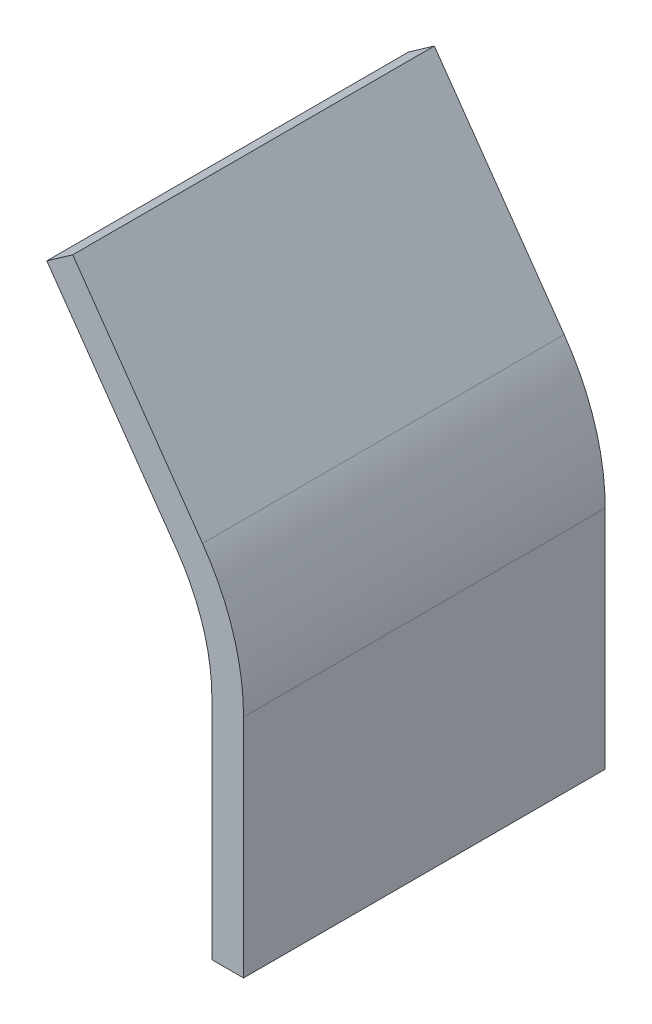
ISO-10303-21;
HEADER;
FILE_DESCRIPTION(('STEP AP214'),'2;1');
FILE_NAME('part.step','',(''),(''),'','','');
FILE_SCHEMA(('AUTOMOTIVE_DESIGN { 1 0 10303 214 1 1 1 1 }'));
ENDSEC;
DATA;
#1=APPLICATION_CONTEXT('core data for automotive mechanical design processes');
#2=APPLICATION_PROTOCOL_DEFINITION('international standard','automotive_design',2000,#1);
#3=PRODUCT_CONTEXT('',#1,'mechanical');
#4=PRODUCT('Part','Part','',(#3));
#5=PRODUCT_RELATED_PRODUCT_CATEGORY('part','',(#4));
#6=PRODUCT_DEFINITION_FORMATION('','',#4);
#7=PRODUCT_DEFINITION_CONTEXT('part definition',#1,'design');
#8=PRODUCT_DEFINITION('design','',#6,#7);
#9=PRODUCT_DEFINITION_SHAPE('','',#8);
#10=(LENGTH_UNIT() NAMED_UNIT(*) SI_UNIT(.MILLI.,.METRE.));
#11=(NAMED_UNIT(*) PLANE_ANGLE_UNIT() SI_UNIT($,.RADIAN.));
#12=(NAMED_UNIT(*) SI_UNIT($,.STERADIAN.) SOLID_ANGLE_UNIT());
#13=UNCERTAINTY_MEASURE_WITH_UNIT(LENGTH_MEASURE(1.E-05),#10,'distance_accuracy_value','');
#14=(GEOMETRIC_REPRESENTATION_CONTEXT(3) GLOBAL_UNCERTAINTY_ASSIGNED_CONTEXT((#13)) GLOBAL_UNIT_ASSIGNED_CONTEXT((#10,
#11,#12)) REPRESENTATION_CONTEXT('',''));
#15=CARTESIAN_POINT('',(0.,0.,0.));
#16=DIRECTION('',(0.,0.,1.));
#17=DIRECTION('',(1.,0.,0.));
#18=AXIS2_PLACEMENT_3D('',#15,#16,#17);
#19=CARTESIAN_POINT('',(-3.5,25.,20.));
#20=DIRECTION('',(1.,0.,0.));
#21=DIRECTION('',(0.,0.,-1.));
#22=AXIS2_PLACEMENT_3D('',#19,#20,#21);
#23=PLANE('',#22);
#24=DIRECTION('',(0.,1.,0.));
#25=VECTOR('',#24,1.);
#26=CARTESIAN_POINT('',(-3.5,25.,-20.));
#27=LINE('',#26,#25);
#28=CARTESIAN_POINT('',(-3.5,25.,-20.));
#29=VERTEX_POINT('',#28);
#30=CARTESIAN_POINT('',(-3.5,0.,-20.));
#31=VERTEX_POINT('',#30);
#32=EDGE_CURVE('E142',#29,#31,#27,.F.);
#33=ORIENTED_EDGE('',*,*,#32,.T.);
#34=DIRECTION('',(0.,0.,-1.));
#35=VECTOR('',#34,1.);
#36=CARTESIAN_POINT('',(-3.5,0.,20.));
#37=LINE('',#36,#35);
#38=CARTESIAN_POINT('',(-3.5,0.,20.));
#39=VERTEX_POINT('',#38);
#40=EDGE_CURVE('E11',#39,#31,#37,.T.);
#41=ORIENTED_EDGE('',*,*,#40,.F.);
#42=DIRECTION('',(0.,1.,0.));
#43=VECTOR('',#42,1.);
#44=CARTESIAN_POINT('',(-3.5,25.,20.));
#45=LINE('',#44,#43);
#46=CARTESIAN_POINT('',(-3.5,25.,20.));
#47=VERTEX_POINT('',#46);
#48=EDGE_CURVE('E95',#47,#39,#45,.F.);
#49=ORIENTED_EDGE('',*,*,#48,.F.);
#50=DIRECTION('',(0.,0.,-1.));
#51=VECTOR('',#50,1.);
#52=CARTESIAN_POINT('',(-3.5,25.,20.));
#53=LINE('',#52,#51);
#54=EDGE_CURVE('E141',#47,#29,#53,.T.);
#55=ORIENTED_EDGE('',*,*,#54,.T.);
#56=EDGE_LOOP('',(#33,#41,#49,#55));
#57=FACE_BOUND('',#56,.T.);
#58=ADVANCED_FACE('F39',(#57),#23,.F.);
#59=CARTESIAN_POINT('',(0.,0.,20.));
#60=DIRECTION('',(0.,-1.,0.));
#61=DIRECTION('',(0.,0.,-1.));
#62=AXIS2_PLACEMENT_3D('',#59,#60,#61);
#63=PLANE('',#62);
#64=DIRECTION('',(-1.,0.,0.));
#65=VECTOR('',#64,1.);
#66=CARTESIAN_POINT('',(0.,0.,-20.));
#67=LINE('',#66,#65);
#68=CARTESIAN_POINT('',(0.,0.,-20.));
#69=VERTEX_POINT('',#68);
#70=EDGE_CURVE('E146',#69,#31,#67,.T.);
#71=ORIENTED_EDGE('',*,*,#70,.F.);
#72=DIRECTION('',(0.,0.,-1.));
#73=VECTOR('',#72,1.);
#74=CARTESIAN_POINT('',(0.,0.,20.));
#75=LINE('',#74,#73);
#76=CARTESIAN_POINT('',(0.,0.,20.));
#77=VERTEX_POINT('',#76);
#78=EDGE_CURVE('E48',#77,#69,#75,.T.);
#79=ORIENTED_EDGE('',*,*,#78,.F.);
#80=DIRECTION('',(-1.,0.,0.));
#81=VECTOR('',#80,1.);
#82=CARTESIAN_POINT('',(0.,0.,20.));
#83=LINE('',#82,#81);
#84=EDGE_CURVE('E198',#77,#39,#83,.T.);
#85=ORIENTED_EDGE('',*,*,#84,.T.);
#86=ORIENTED_EDGE('',*,*,#40,.T.);
#87=EDGE_LOOP('',(#71,#79,#85,#86));
#88=FACE_BOUND('',#87,.T.);
#89=ADVANCED_FACE('F189',(#88),#63,.T.);
#90=CARTESIAN_POINT('',(0.,25.,20.));
#91=DIRECTION('',(1.,0.,0.));
#92=DIRECTION('',(0.,0.,-1.));
#93=AXIS2_PLACEMENT_3D('',#90,#91,#92);
#94=PLANE('',#93);
#95=DIRECTION('',(0.,-1.,0.));
#96=VECTOR('',#95,1.);
#97=CARTESIAN_POINT('',(0.,25.,-20.));
#98=LINE('',#97,#96);
#99=CARTESIAN_POINT('',(0.,25.,-20.));
#100=VERTEX_POINT('',#99);
#101=EDGE_CURVE('E150',#100,#69,#98,.T.);
#102=ORIENTED_EDGE('',*,*,#101,.F.);
#103=DIRECTION('',(0.,0.,-1.));
#104=VECTOR('',#103,1.);
#105=CARTESIAN_POINT('',(0.,25.,20.));
#106=LINE('',#105,#104);
#107=CARTESIAN_POINT('',(0.,25.,20.));
#108=VERTEX_POINT('',#107);
#109=EDGE_CURVE('E177',#108,#100,#106,.T.);
#110=ORIENTED_EDGE('',*,*,#109,.F.);
#111=DIRECTION('',(0.,-1.,0.));
#112=VECTOR('',#111,1.);
#113=CARTESIAN_POINT('',(0.,25.,20.));
#114=LINE('',#113,#112);
#115=EDGE_CURVE('E186',#108,#77,#114,.T.);
#116=ORIENTED_EDGE('',*,*,#115,.T.);
#117=ORIENTED_EDGE('',*,*,#78,.T.);
#118=EDGE_LOOP('',(#102,#110,#116,#117));
#119=FACE_BOUND('',#118,.T.);
#120=ADVANCED_FACE('F184',(#119),#94,.T.);
#121=CARTESIAN_POINT('',(-25.,25.,20.));
#122=DIRECTION('',(0.,0.,-1.));
#123=DIRECTION('',(-1.,0.,0.));
#124=AXIS2_PLACEMENT_3D('',#121,#122,#123);
#125=CYLINDRICAL_SURFACE('',#124,25.);
#126=CARTESIAN_POINT('',(-25.,25.,-20.));
#127=DIRECTION('',(0.,0.,-1.));
#128=DIRECTION('',(-1.,0.,0.));
#129=AXIS2_PLACEMENT_3D('',#126,#127,#128);
#130=CIRCLE('',#129,25.);
#131=CARTESIAN_POINT('',(-4.53622631477816,39.3608483927664,-20.));
#132=VERTEX_POINT('',#131);
#133=EDGE_CURVE('E154',#132,#100,#130,.T.);
#134=ORIENTED_EDGE('',*,*,#133,.F.);
#135=DIRECTION('',(0.,0.,-1.));
#136=VECTOR('',#135,1.);
#137=CARTESIAN_POINT('',(-4.53622631477816,39.3608483927664,20.));
#138=LINE('',#137,#136);
#139=CARTESIAN_POINT('',(-4.53622631477816,39.3608483927664,20.));
#140=VERTEX_POINT('',#139);
#141=EDGE_CURVE('E174',#140,#132,#138,.T.);
#142=ORIENTED_EDGE('',*,*,#141,.F.);
#143=CARTESIAN_POINT('',(-25.,25.,20.));
#144=DIRECTION('',(0.,0.,-1.));
#145=DIRECTION('',(-1.,0.,0.));
#146=AXIS2_PLACEMENT_3D('',#143,#144,#145);
#147=CIRCLE('',#146,25.);
#148=EDGE_CURVE('E135',#140,#108,#147,.T.);
#149=ORIENTED_EDGE('',*,*,#148,.T.);
#150=ORIENTED_EDGE('',*,*,#109,.T.);
#151=EDGE_LOOP('',(#134,#142,#149,#150));
#152=FACE_BOUND('',#151,.T.);
#153=ADVANCED_FACE('F196',(#152),#125,.T.);
#154=CARTESIAN_POINT('',(-18.8970747075446,59.8246220779883,20.));
#155=DIRECTION('',(0.818550947408874,0.574433935710657,0.));
#156=DIRECTION('',(-0.574433935710657,0.818550947408874,0.));
#157=AXIS2_PLACEMENT_3D('',#154,#155,#156);
#158=PLANE('',#157);
#159=DIRECTION('',(0.574433935710657,-0.818550947408874,0.));
#160=VECTOR('',#159,1.);
#161=CARTESIAN_POINT('',(-18.8970747075446,59.8246220779883,-20.));
#162=LINE('',#161,#160);
#163=CARTESIAN_POINT('',(-18.8970747075446,59.8246220779883,-20.));
#164=VERTEX_POINT('',#163);
#165=EDGE_CURVE('E158',#164,#132,#162,.T.);
#166=ORIENTED_EDGE('',*,*,#165,.F.);
#167=DIRECTION('',(0.,0.,-1.));
#168=VECTOR('',#167,1.);
#169=CARTESIAN_POINT('',(-18.8970747075446,59.8246220779883,20.));
#170=LINE('',#169,#168);
#171=CARTESIAN_POINT('',(-18.8970747075446,59.8246220779883,20.));
#172=VERTEX_POINT('',#171);
#173=EDGE_CURVE('E120',#172,#164,#170,.T.);
#174=ORIENTED_EDGE('',*,*,#173,.F.);
#175=DIRECTION('',(0.574433935710657,-0.818550947408874,0.));
#176=VECTOR('',#175,1.);
#177=CARTESIAN_POINT('',(-18.8970747075446,59.8246220779883,20.));
#178=LINE('',#177,#176);
#179=EDGE_CURVE('E131',#172,#140,#178,.T.);
#180=ORIENTED_EDGE('',*,*,#179,.T.);
#181=ORIENTED_EDGE('',*,*,#141,.T.);
#182=EDGE_LOOP('',(#166,#174,#180,#181));
#183=FACE_BOUND('',#182,.T.);
#184=ADVANCED_FACE('F207',(#183),#158,.T.);
#185=CARTESIAN_POINT('',(-21.7620030234756,57.814103303001,20.));
#186=DIRECTION('',(-0.574433935710657,0.818550947408874,0.));
#187=DIRECTION('',(-0.818550947408874,-0.574433935710657,0.));
#188=AXIS2_PLACEMENT_3D('',#185,#186,#187);
#189=PLANE('',#188);
#190=DIRECTION('',(0.818550947408874,0.574433935710657,0.));
#191=VECTOR('',#190,1.);
#192=CARTESIAN_POINT('',(-21.7620030234756,57.814103303001,-20.));
#193=LINE('',#192,#191);
#194=CARTESIAN_POINT('',(-21.7620030234756,57.814103303001,-20.));
#195=VERTEX_POINT('',#194);
#196=EDGE_CURVE('E118',#195,#164,#193,.T.);
#197=ORIENTED_EDGE('',*,*,#196,.F.);
#198=DIRECTION('',(0.,0.,-1.));
#199=VECTOR('',#198,1.);
#200=CARTESIAN_POINT('',(-21.7620030234756,57.814103303001,20.));
#201=LINE('',#200,#199);
#202=CARTESIAN_POINT('',(-21.7620030234756,57.814103303001,20.));
#203=VERTEX_POINT('',#202);
#204=EDGE_CURVE('E112',#203,#195,#201,.T.);
#205=ORIENTED_EDGE('',*,*,#204,.F.);
#206=DIRECTION('',(0.818550947408874,0.574433935710657,0.));
#207=VECTOR('',#206,1.);
#208=CARTESIAN_POINT('',(-21.7620030234756,57.814103303001,20.));
#209=LINE('',#208,#207);
#210=EDGE_CURVE('E116',#203,#172,#209,.T.);
#211=ORIENTED_EDGE('',*,*,#210,.T.);
#212=ORIENTED_EDGE('',*,*,#173,.T.);
#213=EDGE_LOOP('',(#197,#205,#211,#212));
#214=FACE_BOUND('',#213,.T.);
#215=ADVANCED_FACE('F114',(#214),#189,.T.);
#216=CARTESIAN_POINT('',(-21.7620030234756,57.814103303001,20.));
#217=DIRECTION('',(0.818550947408874,0.574433935710657,0.));
#218=DIRECTION('',(-0.574433935710657,0.818550947408874,0.));
#219=AXIS2_PLACEMENT_3D('',#216,#217,#218);
#220=PLANE('',#219);
#221=DIRECTION('',(0.574433935710657,-0.818550947408874,0.));
#222=VECTOR('',#221,1.);
#223=CARTESIAN_POINT('',(-21.7620030234756,57.814103303001,-20.));
#224=LINE('',#223,#222);
#225=CARTESIAN_POINT('',(-7.40115463070921,37.3503296177791,-20.));
#226=VERTEX_POINT('',#225);
#227=EDGE_CURVE('E83',#195,#226,#224,.T.);
#228=ORIENTED_EDGE('',*,*,#227,.T.);
#229=DIRECTION('',(0.,0.,-1.));
#230=VECTOR('',#229,1.);
#231=CARTESIAN_POINT('',(-7.40115463070921,37.3503296177791,20.));
#232=LINE('',#231,#230);
#233=CARTESIAN_POINT('',(-7.40115463070921,37.3503296177791,20.));
#234=VERTEX_POINT('',#233);
#235=EDGE_CURVE('E121',#234,#226,#232,.T.);
#236=ORIENTED_EDGE('',*,*,#235,.F.);
#237=DIRECTION('',(0.574433935710657,-0.818550947408874,0.));
#238=VECTOR('',#237,1.);
#239=CARTESIAN_POINT('',(-21.7620030234756,57.814103303001,20.));
#240=LINE('',#239,#238);
#241=EDGE_CURVE('E123',#203,#234,#240,.T.);
#242=ORIENTED_EDGE('',*,*,#241,.F.);
#243=ORIENTED_EDGE('',*,*,#204,.T.);
#244=EDGE_LOOP('',(#228,#236,#242,#243));
#245=FACE_BOUND('',#244,.T.);
#246=ADVANCED_FACE('F124',(#245),#220,.F.);
#247=CARTESIAN_POINT('',(-25.,25.,20.));
#248=DIRECTION('',(0.,0.,-1.));
#249=DIRECTION('',(-1.,0.,0.));
#250=AXIS2_PLACEMENT_3D('',#247,#248,#249);
#251=CYLINDRICAL_SURFACE('',#250,21.5);
#252=CARTESIAN_POINT('',(-25.,25.,-20.));
#253=DIRECTION('',(0.,0.,1.));
#254=DIRECTION('',(1.,0.,0.));
#255=AXIS2_PLACEMENT_3D('',#252,#253,#254);
#256=CIRCLE('',#255,21.5);
#257=EDGE_CURVE('E89',#226,#29,#256,.F.);
#258=ORIENTED_EDGE('',*,*,#257,.T.);
#259=ORIENTED_EDGE('',*,*,#54,.F.);
#260=CARTESIAN_POINT('',(-25.,25.,20.));
#261=DIRECTION('',(0.,0.,1.));
#262=DIRECTION('',(1.,0.,0.));
#263=AXIS2_PLACEMENT_3D('',#260,#261,#262);
#264=CIRCLE('',#263,21.5);
#265=EDGE_CURVE('E56',#234,#47,#264,.F.);
#266=ORIENTED_EDGE('',*,*,#265,.F.);
#267=ORIENTED_EDGE('',*,*,#235,.T.);
#268=EDGE_LOOP('',(#258,#259,#266,#267));
#269=FACE_BOUND('',#268,.T.);
#270=ADVANCED_FACE('F209',(#269),#251,.F.);
#271=CARTESIAN_POINT('',(-25.,25.,20.));
#272=DIRECTION('',(0.,0.,-1.));
#273=DIRECTION('',(-1.,0.,0.));
#274=AXIS2_PLACEMENT_3D('',#271,#272,#273);
#275=PLANE('',#274);
#276=ORIENTED_EDGE('',*,*,#48,.T.);
#277=ORIENTED_EDGE('',*,*,#84,.F.);
#278=ORIENTED_EDGE('',*,*,#115,.F.);
#279=ORIENTED_EDGE('',*,*,#148,.F.);
#280=ORIENTED_EDGE('',*,*,#179,.F.);
#281=ORIENTED_EDGE('',*,*,#210,.F.);
#282=ORIENTED_EDGE('',*,*,#241,.T.);
#283=ORIENTED_EDGE('',*,*,#265,.T.);
#284=EDGE_LOOP('',(#276,#277,#278,#279,#280,#281,#282,#283));
#285=FACE_BOUND('',#284,.T.);
#286=ADVANCED_FACE('F128',(#285),#275,.F.);
#287=CARTESIAN_POINT('',(-25.,25.,-20.));
#288=DIRECTION('',(0.,0.,-1.));
#289=DIRECTION('',(-1.,0.,0.));
#290=AXIS2_PLACEMENT_3D('',#287,#288,#289);
#291=PLANE('',#290);
#292=ORIENTED_EDGE('',*,*,#32,.F.);
#293=ORIENTED_EDGE('',*,*,#257,.F.);
#294=ORIENTED_EDGE('',*,*,#227,.F.);
#295=ORIENTED_EDGE('',*,*,#196,.T.);
#296=ORIENTED_EDGE('',*,*,#165,.T.);
#297=ORIENTED_EDGE('',*,*,#133,.T.);
#298=ORIENTED_EDGE('',*,*,#101,.T.);
#299=ORIENTED_EDGE('',*,*,#70,.T.);
#300=EDGE_LOOP('',(#292,#293,#294,#295,#296,#297,#298,#299));
#301=FACE_BOUND('',#300,.T.);
#302=ADVANCED_FACE('F192',(#301),#291,.T.);
#303=CLOSED_SHELL('',(#58,#89,#120,#153,#184,#215,#246,#270,#286,#302));
#304=MANIFOLD_SOLID_BREP('B2',#303);
#305=ADVANCED_BREP_SHAPE_REPRESENTATION('',(#18,#304),#14);
#306=SHAPE_DEFINITION_REPRESENTATION(#9,#305);
ENDSEC;
END-ISO-10303-21;
